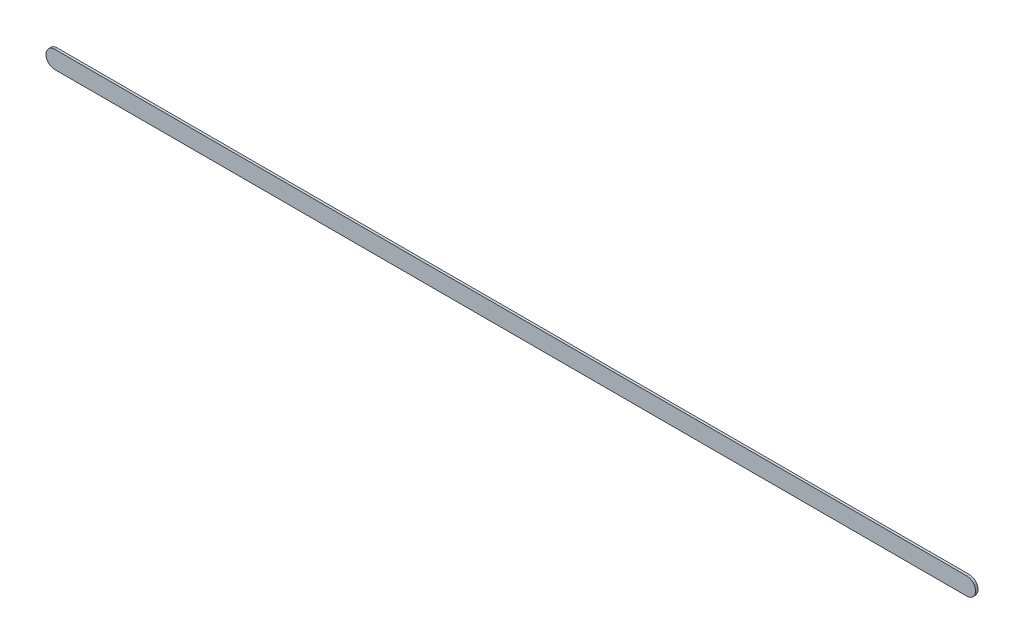
ISO-10303-21;
HEADER;
FILE_DESCRIPTION(('STEP AP214'),'2;1');
FILE_NAME('part.step','',(''),(''),'','','');
FILE_SCHEMA(('AUTOMOTIVE_DESIGN { 1 0 10303 214 1 1 1 1 }'));
ENDSEC;
DATA;
#1=APPLICATION_CONTEXT('core data for automotive mechanical design processes');
#2=APPLICATION_PROTOCOL_DEFINITION('international standard','automotive_design',2000,#1);
#3=PRODUCT_CONTEXT('',#1,'mechanical');
#4=PRODUCT('Part','Part','',(#3));
#5=PRODUCT_RELATED_PRODUCT_CATEGORY('part','',(#4));
#6=PRODUCT_DEFINITION_FORMATION('','',#4);
#7=PRODUCT_DEFINITION_CONTEXT('part definition',#1,'design');
#8=PRODUCT_DEFINITION('design','',#6,#7);
#9=PRODUCT_DEFINITION_SHAPE('','',#8);
#10=(LENGTH_UNIT() NAMED_UNIT(*) SI_UNIT(.MILLI.,.METRE.));
#11=(NAMED_UNIT(*) PLANE_ANGLE_UNIT() SI_UNIT($,.RADIAN.));
#12=(NAMED_UNIT(*) SI_UNIT($,.STERADIAN.) SOLID_ANGLE_UNIT());
#13=UNCERTAINTY_MEASURE_WITH_UNIT(LENGTH_MEASURE(1.E-05),#10,'distance_accuracy_value','');
#14=(GEOMETRIC_REPRESENTATION_CONTEXT(3) GLOBAL_UNCERTAINTY_ASSIGNED_CONTEXT((#13)) GLOBAL_UNIT_ASSIGNED_CONTEXT((#10,
#11,#12)) REPRESENTATION_CONTEXT('',''));
#15=CARTESIAN_POINT('',(0.,0.,0.));
#16=DIRECTION('',(0.,0.,1.));
#17=DIRECTION('',(1.,0.,0.));
#18=AXIS2_PLACEMENT_3D('',#15,#16,#17);
#19=CARTESIAN_POINT('',(86.2169726,104.85997316,0.));
#20=DIRECTION('',(0.,1.,0.));
#21=DIRECTION('',(1.,0.,0.));
#22=AXIS2_PLACEMENT_3D('',#19,#20,#21);
#23=PLANE('',#22);
#24=DIRECTION('',(1.,0.,0.));
#25=VECTOR('',#24,1.);
#26=CARTESIAN_POINT('',(86.2169726,104.85997316,0.03556));
#27=LINE('',#26,#25);
#28=CARTESIAN_POINT('',(86.2169726,104.85997316,0.03556));
#29=VERTEX_POINT('',#28);
#30=CARTESIAN_POINT('',(99.4169716,104.85997316,0.03556));
#31=VERTEX_POINT('',#30);
#32=EDGE_CURVE('E11',#29,#31,#27,.T.);
#33=ORIENTED_EDGE('',*,*,#32,.F.);
#34=DIRECTION('',(0.,0.,1.));
#35=VECTOR('',#34,1.);
#36=CARTESIAN_POINT('',(86.2169726,104.85997316,0.));
#37=LINE('',#36,#35);
#38=CARTESIAN_POINT('',(86.2169726,104.85997316,0.));
#39=VERTEX_POINT('',#38);
#40=EDGE_CURVE('E24',#39,#29,#37,.T.);
#41=ORIENTED_EDGE('',*,*,#40,.F.);
#42=DIRECTION('',(1.,0.,0.));
#43=VECTOR('',#42,1.);
#44=CARTESIAN_POINT('',(86.2169726,104.85997316,0.));
#45=LINE('',#44,#43);
#46=CARTESIAN_POINT('',(99.4169716,104.85997316,0.));
#47=VERTEX_POINT('',#46);
#48=EDGE_CURVE('E75',#39,#47,#45,.T.);
#49=ORIENTED_EDGE('',*,*,#48,.T.);
#50=DIRECTION('',(0.,0.,1.));
#51=VECTOR('',#50,1.);
#52=CARTESIAN_POINT('',(99.4169716,104.85997316,0.));
#53=LINE('',#52,#51);
#54=EDGE_CURVE('E37',#47,#31,#53,.T.);
#55=ORIENTED_EDGE('',*,*,#54,.T.);
#56=EDGE_LOOP('',(#33,#41,#49,#55));
#57=FACE_BOUND('',#56,.T.);
#58=ADVANCED_FACE('F17',(#57),#23,.F.);
#59=CARTESIAN_POINT('',(99.4169716,104.98697316,0.));
#60=DIRECTION('',(0.,0.,-1.));
#61=DIRECTION('',(-1.11896493820492E-13,-1.,0.));
#62=AXIS2_PLACEMENT_3D('',#59,#60,#61);
#63=CYLINDRICAL_SURFACE('',#62,0.126999999999995);
#64=CARTESIAN_POINT('',(99.4169716,104.98697316,0.03556));
#65=DIRECTION('',(0.,0.,1.));
#66=DIRECTION('',(-1.11896493820492E-13,-1.,0.));
#67=AXIS2_PLACEMENT_3D('',#64,#65,#66);
#68=CIRCLE('',#67,0.126999999999995);
#69=CARTESIAN_POINT('',(99.4169716,105.11397316,0.03556));
#70=VERTEX_POINT('',#69);
#71=EDGE_CURVE('E83',#31,#70,#68,.T.);
#72=ORIENTED_EDGE('',*,*,#71,.F.);
#73=ORIENTED_EDGE('',*,*,#54,.F.);
#74=CARTESIAN_POINT('',(99.4169716,104.98697316,0.));
#75=DIRECTION('',(0.,0.,1.));
#76=DIRECTION('',(-1.11896493820492E-13,-1.,0.));
#77=AXIS2_PLACEMENT_3D('',#74,#75,#76);
#78=CIRCLE('',#77,0.126999999999995);
#79=CARTESIAN_POINT('',(99.4169716,105.11397316,0.));
#80=VERTEX_POINT('',#79);
#81=EDGE_CURVE('E81',#47,#80,#78,.T.);
#82=ORIENTED_EDGE('',*,*,#81,.T.);
#83=DIRECTION('',(0.,0.,1.));
#84=VECTOR('',#83,1.);
#85=CARTESIAN_POINT('',(99.4169716,105.11397316,0.));
#86=LINE('',#85,#84);
#87=EDGE_CURVE('E67',#80,#70,#86,.T.);
#88=ORIENTED_EDGE('',*,*,#87,.T.);
#89=EDGE_LOOP('',(#72,#73,#82,#88));
#90=FACE_BOUND('',#89,.T.);
#91=ADVANCED_FACE('F89',(#90),#63,.T.);
#92=CARTESIAN_POINT('',(99.4169716,105.11397316,0.));
#93=DIRECTION('',(0.,-1.,0.));
#94=DIRECTION('',(-1.,0.,0.));
#95=AXIS2_PLACEMENT_3D('',#92,#93,#94);
#96=PLANE('',#95);
#97=DIRECTION('',(-1.,0.,0.));
#98=VECTOR('',#97,1.);
#99=CARTESIAN_POINT('',(99.4169716,105.11397316,0.03556));
#100=LINE('',#99,#98);
#101=CARTESIAN_POINT('',(86.2169726,105.11397316,0.03556));
#102=VERTEX_POINT('',#101);
#103=EDGE_CURVE('E71',#70,#102,#100,.T.);
#104=ORIENTED_EDGE('',*,*,#103,.F.);
#105=ORIENTED_EDGE('',*,*,#87,.F.);
#106=DIRECTION('',(-1.,0.,0.));
#107=VECTOR('',#106,1.);
#108=CARTESIAN_POINT('',(99.4169716,105.11397316,0.));
#109=LINE('',#108,#107);
#110=CARTESIAN_POINT('',(86.2169726,105.11397316,0.));
#111=VERTEX_POINT('',#110);
#112=EDGE_CURVE('E63',#80,#111,#109,.T.);
#113=ORIENTED_EDGE('',*,*,#112,.T.);
#114=DIRECTION('',(0.,0.,1.));
#115=VECTOR('',#114,1.);
#116=CARTESIAN_POINT('',(86.2169726,105.11397316,0.));
#117=LINE('',#116,#115);
#118=EDGE_CURVE('E53',#111,#102,#117,.T.);
#119=ORIENTED_EDGE('',*,*,#118,.T.);
#120=EDGE_LOOP('',(#104,#105,#113,#119));
#121=FACE_BOUND('',#120,.T.);
#122=ADVANCED_FACE('F66',(#121),#96,.F.);
#123=CARTESIAN_POINT('',(86.2169726,104.98697316,0.));
#124=DIRECTION('',(0.,0.,-1.));
#125=DIRECTION('',(1.11896493820492E-13,1.,0.));
#126=AXIS2_PLACEMENT_3D('',#123,#124,#125);
#127=CYLINDRICAL_SURFACE('',#126,0.126999999999991);
#128=CARTESIAN_POINT('',(86.2169726,104.98697316,0.03556));
#129=DIRECTION('',(0.,0.,1.));
#130=DIRECTION('',(1.11896493820492E-13,1.,0.));
#131=AXIS2_PLACEMENT_3D('',#128,#129,#130);
#132=CIRCLE('',#131,0.126999999999991);
#133=EDGE_CURVE('E59',#102,#29,#132,.T.);
#134=ORIENTED_EDGE('',*,*,#133,.F.);
#135=ORIENTED_EDGE('',*,*,#118,.F.);
#136=CARTESIAN_POINT('',(86.2169726,104.98697316,0.));
#137=DIRECTION('',(0.,0.,1.));
#138=DIRECTION('',(1.11896493820492E-13,1.,0.));
#139=AXIS2_PLACEMENT_3D('',#136,#137,#138);
#140=CIRCLE('',#139,0.126999999999991);
#141=EDGE_CURVE('E57',#111,#39,#140,.T.);
#142=ORIENTED_EDGE('',*,*,#141,.T.);
#143=ORIENTED_EDGE('',*,*,#40,.T.);
#144=EDGE_LOOP('',(#134,#135,#142,#143));
#145=FACE_BOUND('',#144,.T.);
#146=ADVANCED_FACE('F55',(#145),#127,.T.);
#147=CARTESIAN_POINT('',(86.2169726,104.85997316,0.));
#148=DIRECTION('',(0.,0.,-1.));
#149=DIRECTION('',(-1.,0.,0.));
#150=AXIS2_PLACEMENT_3D('',#147,#148,#149);
#151=PLANE('',#150);
#152=ORIENTED_EDGE('',*,*,#141,.F.);
#153=ORIENTED_EDGE('',*,*,#112,.F.);
#154=ORIENTED_EDGE('',*,*,#81,.F.);
#155=ORIENTED_EDGE('',*,*,#48,.F.);
#156=EDGE_LOOP('',(#152,#153,#154,#155));
#157=FACE_BOUND('',#156,.T.);
#158=ADVANCED_FACE('F74',(#157),#151,.T.);
#159=CARTESIAN_POINT('',(86.2169726,104.85997316,0.03556));
#160=DIRECTION('',(0.,0.,-1.));
#161=DIRECTION('',(-1.,0.,0.));
#162=AXIS2_PLACEMENT_3D('',#159,#160,#161);
#163=PLANE('',#162);
#164=ORIENTED_EDGE('',*,*,#32,.T.);
#165=ORIENTED_EDGE('',*,*,#71,.T.);
#166=ORIENTED_EDGE('',*,*,#103,.T.);
#167=ORIENTED_EDGE('',*,*,#133,.T.);
#168=EDGE_LOOP('',(#164,#165,#166,#167));
#169=FACE_BOUND('',#168,.T.);
#170=ADVANCED_FACE('F91',(#169),#163,.F.);
#171=CLOSED_SHELL('',(#58,#91,#122,#146,#158,#170));
#172=MANIFOLD_SOLID_BREP('B1',#171);
#173=ADVANCED_BREP_SHAPE_REPRESENTATION('',(#18,#172),#14);
#174=SHAPE_DEFINITION_REPRESENTATION(#9,#173);
ENDSEC;
END-ISO-10303-21;
